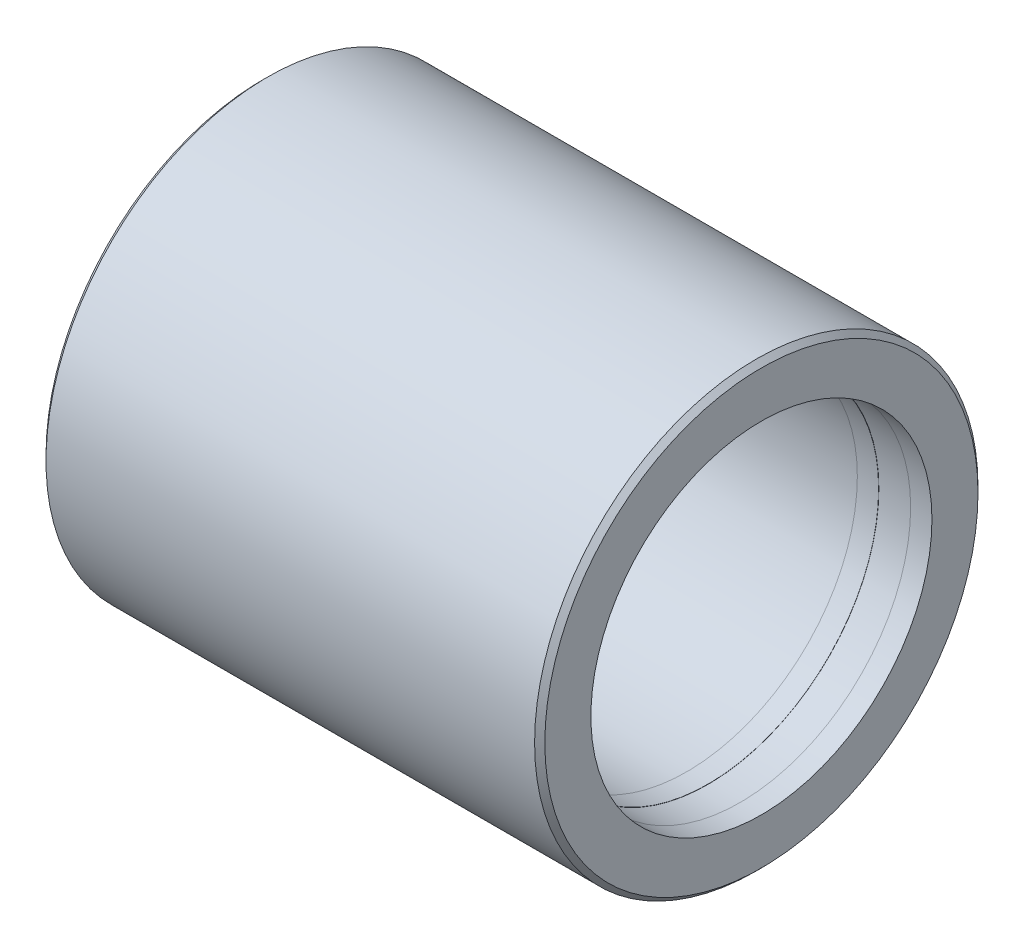
ISO-10303-21;
HEADER;
FILE_DESCRIPTION(('STEP AP214'),'2;1');
FILE_NAME('part.step','',(''),(''),'','','');
FILE_SCHEMA(('AUTOMOTIVE_DESIGN { 1 0 10303 214 1 1 1 1 }'));
ENDSEC;
DATA;
#1=APPLICATION_CONTEXT('core data for automotive mechanical design processes');
#2=APPLICATION_PROTOCOL_DEFINITION('international standard','automotive_design',2000,#1);
#3=PRODUCT_CONTEXT('',#1,'mechanical');
#4=PRODUCT('Part','Part','',(#3));
#5=PRODUCT_RELATED_PRODUCT_CATEGORY('part','',(#4));
#6=PRODUCT_DEFINITION_FORMATION('','',#4);
#7=PRODUCT_DEFINITION_CONTEXT('part definition',#1,'design');
#8=PRODUCT_DEFINITION('design','',#6,#7);
#9=PRODUCT_DEFINITION_SHAPE('','',#8);
#10=(LENGTH_UNIT() NAMED_UNIT(*) SI_UNIT(.MILLI.,.METRE.));
#11=(NAMED_UNIT(*) PLANE_ANGLE_UNIT() SI_UNIT($,.RADIAN.));
#12=(NAMED_UNIT(*) SI_UNIT($,.STERADIAN.) SOLID_ANGLE_UNIT());
#13=UNCERTAINTY_MEASURE_WITH_UNIT(LENGTH_MEASURE(1.E-05),#10,'distance_accuracy_value','');
#14=(GEOMETRIC_REPRESENTATION_CONTEXT(3) GLOBAL_UNCERTAINTY_ASSIGNED_CONTEXT((#13)) GLOBAL_UNIT_ASSIGNED_CONTEXT((#10,
#11,#12)) REPRESENTATION_CONTEXT('',''));
#15=CARTESIAN_POINT('',(0.,0.,0.));
#16=DIRECTION('',(0.,0.,1.));
#17=DIRECTION('',(1.,0.,0.));
#18=AXIS2_PLACEMENT_3D('',#15,#16,#17);
#19=CARTESIAN_POINT('',(5.55625,0.,0.));
#20=DIRECTION('',(1.,0.,0.));
#21=DIRECTION('',(0.,0.,-1.));
#22=AXIS2_PLACEMENT_3D('',#19,#20,#21);
#23=CYLINDRICAL_SURFACE('',#22,12.715840435);
#24=CARTESIAN_POINT('',(31.59125,0.,0.));
#25=DIRECTION('',(1.,0.,0.));
#26=DIRECTION('',(0.,0.,-1.));
#27=AXIS2_PLACEMENT_3D('',#24,#25,#26);
#28=CIRCLE('',#27,12.715840435);
#29=CARTESIAN_POINT('',(31.59125,0.,-12.715840435));
#30=VERTEX_POINT('',#29);
#31=EDGE_CURVE('E18',#30,#30,#28,.F.);
#32=ORIENTED_EDGE('',*,*,#31,.F.);
#33=EDGE_LOOP('',(#32));
#34=FACE_BOUND('',#33,.T.);
#35=CARTESIAN_POINT('',(5.55625,0.,0.));
#36=DIRECTION('',(1.,0.,0.));
#37=DIRECTION('',(0.,0.,-1.));
#38=AXIS2_PLACEMENT_3D('',#35,#36,#37);
#39=CIRCLE('',#38,12.715840435);
#40=CARTESIAN_POINT('',(5.55625,0.,-12.715840435));
#41=VERTEX_POINT('',#40);
#42=EDGE_CURVE('E87',#41,#41,#39,.T.);
#43=ORIENTED_EDGE('',*,*,#42,.F.);
#44=EDGE_LOOP('',(#43));
#45=FACE_BOUND('',#44,.T.);
#46=ADVANCED_FACE('F14',(#34,#45),#23,.F.);
#47=CARTESIAN_POINT('',(31.59125,-12.86843052,-12.86843052));
#48=DIRECTION('',(-1.,0.,0.));
#49=DIRECTION('',(0.,0.,1.));
#50=AXIS2_PLACEMENT_3D('',#47,#48,#49);
#51=PLANE('',#50);
#52=CARTESIAN_POINT('',(31.59125,0.,0.));
#53=DIRECTION('',(1.,0.,0.));
#54=DIRECTION('',(0.,0.,-1.));
#55=AXIS2_PLACEMENT_3D('',#52,#53,#54);
#56=CIRCLE('',#55,12.7);
#57=CARTESIAN_POINT('',(31.59125,0.,-12.7));
#58=VERTEX_POINT('',#57);
#59=EDGE_CURVE('E84',#58,#58,#56,.F.);
#60=ORIENTED_EDGE('',*,*,#59,.F.);
#61=EDGE_LOOP('',(#60));
#62=FACE_BOUND('',#61,.T.);
#63=ORIENTED_EDGE('',*,*,#31,.T.);
#64=EDGE_LOOP('',(#63));
#65=FACE_BOUND('',#64,.T.);
#66=ADVANCED_FACE('F96',(#62,#65),#51,.T.);
#67=CARTESIAN_POINT('',(5.55625,-12.86843052,12.86843052));
#68=DIRECTION('',(1.,0.,0.));
#69=DIRECTION('',(0.,0.,-1.));
#70=AXIS2_PLACEMENT_3D('',#67,#68,#69);
#71=PLANE('',#70);
#72=CARTESIAN_POINT('',(5.55625,0.,0.));
#73=DIRECTION('',(1.,0.,0.));
#74=DIRECTION('',(0.,0.,-1.));
#75=AXIS2_PLACEMENT_3D('',#72,#73,#74);
#76=CIRCLE('',#75,12.7);
#77=CARTESIAN_POINT('',(5.55625,0.,-12.7));
#78=VERTEX_POINT('',#77);
#79=EDGE_CURVE('E80',#78,#78,#76,.T.);
#80=ORIENTED_EDGE('',*,*,#79,.F.);
#81=EDGE_LOOP('',(#80));
#82=FACE_BOUND('',#81,.T.);
#83=ORIENTED_EDGE('',*,*,#42,.T.);
#84=EDGE_LOOP('',(#83));
#85=FACE_BOUND('',#84,.T.);
#86=ADVANCED_FACE('F105',(#82,#85),#71,.T.);
#87=CARTESIAN_POINT('',(31.59125,0.,0.));
#88=DIRECTION('',(1.,0.,0.));
#89=DIRECTION('',(0.,0.,-1.));
#90=AXIS2_PLACEMENT_3D('',#87,#88,#89);
#91=CYLINDRICAL_SURFACE('',#90,12.7);
#92=ORIENTED_EDGE('',*,*,#59,.T.);
#93=EDGE_LOOP('',(#92));
#94=FACE_BOUND('',#93,.T.);
#95=CARTESIAN_POINT('',(33.17875,0.,0.));
#96=DIRECTION('',(1.,0.,0.));
#97=DIRECTION('',(0.,0.,-1.));
#98=AXIS2_PLACEMENT_3D('',#95,#96,#97);
#99=CIRCLE('',#98,12.7);
#100=CARTESIAN_POINT('',(33.17875,0.,-12.7));
#101=VERTEX_POINT('',#100);
#102=EDGE_CURVE('E77',#101,#101,#99,.F.);
#103=ORIENTED_EDGE('',*,*,#102,.F.);
#104=EDGE_LOOP('',(#103));
#105=FACE_BOUND('',#104,.T.);
#106=ADVANCED_FACE('F149',(#94,#105),#91,.F.);
#107=CARTESIAN_POINT('',(3.96875,0.,0.));
#108=DIRECTION('',(1.,0.,0.));
#109=DIRECTION('',(0.,0.,-1.));
#110=AXIS2_PLACEMENT_3D('',#107,#108,#109);
#111=CYLINDRICAL_SURFACE('',#110,12.7);
#112=ORIENTED_EDGE('',*,*,#79,.T.);
#113=EDGE_LOOP('',(#112));
#114=FACE_BOUND('',#113,.T.);
#115=CARTESIAN_POINT('',(3.96875,0.,0.));
#116=DIRECTION('',(1.,0.,0.));
#117=DIRECTION('',(0.,0.,-1.));
#118=AXIS2_PLACEMENT_3D('',#115,#116,#117);
#119=CIRCLE('',#118,12.7);
#120=CARTESIAN_POINT('',(3.96875,0.,-12.7));
#121=VERTEX_POINT('',#120);
#122=EDGE_CURVE('E73',#121,#121,#119,.T.);
#123=ORIENTED_EDGE('',*,*,#122,.F.);
#124=EDGE_LOOP('',(#123));
#125=FACE_BOUND('',#124,.T.);
#126=ADVANCED_FACE('F146',(#114,#125),#111,.F.);
#127=CARTESIAN_POINT('',(33.17875,-12.86843052,12.86843052));
#128=DIRECTION('',(1.,0.,0.));
#129=DIRECTION('',(0.,0.,-1.));
#130=AXIS2_PLACEMENT_3D('',#127,#128,#129);
#131=PLANE('',#130);
#132=ORIENTED_EDGE('',*,*,#102,.T.);
#133=EDGE_LOOP('',(#132));
#134=FACE_BOUND('',#133,.T.);
#135=CARTESIAN_POINT('',(33.17875,0.,0.));
#136=DIRECTION('',(1.,0.,0.));
#137=DIRECTION('',(0.,0.,-1.));
#138=AXIS2_PLACEMENT_3D('',#135,#136,#137);
#139=CIRCLE('',#138,12.715840435);
#140=CARTESIAN_POINT('',(33.17875,0.,-12.715840435));
#141=VERTEX_POINT('',#140);
#142=EDGE_CURVE('E69',#141,#141,#139,.F.);
#143=ORIENTED_EDGE('',*,*,#142,.F.);
#144=EDGE_LOOP('',(#143));
#145=FACE_BOUND('',#144,.T.);
#146=ADVANCED_FACE('F148',(#134,#145),#131,.T.);
#147=CARTESIAN_POINT('',(3.96875,-12.86843052,-12.86843052));
#148=DIRECTION('',(-1.,0.,0.));
#149=DIRECTION('',(0.,0.,1.));
#150=AXIS2_PLACEMENT_3D('',#147,#148,#149);
#151=PLANE('',#150);
#152=ORIENTED_EDGE('',*,*,#122,.T.);
#153=EDGE_LOOP('',(#152));
#154=FACE_BOUND('',#153,.T.);
#155=CARTESIAN_POINT('',(3.96875,0.,0.));
#156=DIRECTION('',(1.,0.,0.));
#157=DIRECTION('',(0.,0.,-1.));
#158=AXIS2_PLACEMENT_3D('',#155,#156,#157);
#159=CIRCLE('',#158,12.715840435);
#160=CARTESIAN_POINT('',(3.96875,0.,-12.715840435));
#161=VERTEX_POINT('',#160);
#162=EDGE_CURVE('E65',#161,#161,#159,.T.);
#163=ORIENTED_EDGE('',*,*,#162,.F.);
#164=EDGE_LOOP('',(#163));
#165=FACE_BOUND('',#164,.T.);
#166=ADVANCED_FACE('F144',(#154,#165),#151,.T.);
#167=CARTESIAN_POINT('',(33.17875,0.,0.));
#168=DIRECTION('',(1.,0.,0.));
#169=DIRECTION('',(0.,0.,-1.));
#170=AXIS2_PLACEMENT_3D('',#167,#168,#169);
#171=CYLINDRICAL_SURFACE('',#170,12.715840435);
#172=ORIENTED_EDGE('',*,*,#142,.T.);
#173=EDGE_LOOP('',(#172));
#174=FACE_BOUND('',#173,.T.);
#175=CARTESIAN_POINT('',(35.56,0.,0.));
#176=DIRECTION('',(1.,0.,0.));
#177=DIRECTION('',(0.,0.,-1.));
#178=AXIS2_PLACEMENT_3D('',#175,#176,#177);
#179=CIRCLE('',#178,12.715840435);
#180=CARTESIAN_POINT('',(35.56,0.,-12.715840435));
#181=VERTEX_POINT('',#180);
#182=EDGE_CURVE('E61',#181,#181,#179,.F.);
#183=ORIENTED_EDGE('',*,*,#182,.F.);
#184=EDGE_LOOP('',(#183));
#185=FACE_BOUND('',#184,.T.);
#186=ADVANCED_FACE('F140',(#174,#185),#171,.F.);
#187=CARTESIAN_POINT('',(1.5875,0.,0.));
#188=DIRECTION('',(1.,0.,0.));
#189=DIRECTION('',(0.,0.,-1.));
#190=AXIS2_PLACEMENT_3D('',#187,#188,#189);
#191=CYLINDRICAL_SURFACE('',#190,12.715840435);
#192=ORIENTED_EDGE('',*,*,#162,.T.);
#193=EDGE_LOOP('',(#192));
#194=FACE_BOUND('',#193,.T.);
#195=CARTESIAN_POINT('',(1.5875,0.,0.));
#196=DIRECTION('',(1.,0.,0.));
#197=DIRECTION('',(0.,0.,-1.));
#198=AXIS2_PLACEMENT_3D('',#195,#196,#197);
#199=CIRCLE('',#198,12.715840435);
#200=CARTESIAN_POINT('',(1.5875,0.,-12.715840435));
#201=VERTEX_POINT('',#200);
#202=EDGE_CURVE('E58',#201,#201,#199,.T.);
#203=ORIENTED_EDGE('',*,*,#202,.F.);
#204=EDGE_LOOP('',(#203));
#205=FACE_BOUND('',#204,.T.);
#206=ADVANCED_FACE('F136',(#194,#205),#191,.F.);
#207=CARTESIAN_POINT('',(35.56,-12.86843052,-12.86843052));
#208=DIRECTION('',(-1.,0.,0.));
#209=DIRECTION('',(0.,0.,1.));
#210=AXIS2_PLACEMENT_3D('',#207,#208,#209);
#211=PLANE('',#210);
#212=CARTESIAN_POINT('',(35.56,0.,0.));
#213=DIRECTION('',(1.,0.,0.));
#214=DIRECTION('',(0.,0.,-1.));
#215=AXIS2_PLACEMENT_3D('',#212,#213,#214);
#216=CIRCLE('',#215,12.7);
#217=CARTESIAN_POINT('',(35.56,0.,-12.7));
#218=VERTEX_POINT('',#217);
#219=EDGE_CURVE('E54',#218,#218,#216,.F.);
#220=ORIENTED_EDGE('',*,*,#219,.F.);
#221=EDGE_LOOP('',(#220));
#222=FACE_BOUND('',#221,.T.);
#223=ORIENTED_EDGE('',*,*,#182,.T.);
#224=EDGE_LOOP('',(#223));
#225=FACE_BOUND('',#224,.T.);
#226=ADVANCED_FACE('F139',(#222,#225),#211,.T.);
#227=CARTESIAN_POINT('',(1.5875,-12.86843052,12.86843052));
#228=DIRECTION('',(1.,0.,0.));
#229=DIRECTION('',(0.,0.,-1.));
#230=AXIS2_PLACEMENT_3D('',#227,#228,#229);
#231=PLANE('',#230);
#232=CARTESIAN_POINT('',(1.5875,0.,0.));
#233=DIRECTION('',(1.,0.,0.));
#234=DIRECTION('',(0.,0.,-1.));
#235=AXIS2_PLACEMENT_3D('',#232,#233,#234);
#236=CIRCLE('',#235,12.7);
#237=CARTESIAN_POINT('',(1.5875,0.,-12.7));
#238=VERTEX_POINT('',#237);
#239=EDGE_CURVE('E50',#238,#238,#236,.T.);
#240=ORIENTED_EDGE('',*,*,#239,.F.);
#241=EDGE_LOOP('',(#240));
#242=FACE_BOUND('',#241,.T.);
#243=ORIENTED_EDGE('',*,*,#202,.T.);
#244=EDGE_LOOP('',(#243));
#245=FACE_BOUND('',#244,.T.);
#246=ADVANCED_FACE('F134',(#242,#245),#231,.T.);
#247=CARTESIAN_POINT('',(35.56,0.,0.));
#248=DIRECTION('',(1.,0.,0.));
#249=DIRECTION('',(0.,0.,-1.));
#250=AXIS2_PLACEMENT_3D('',#247,#248,#249);
#251=CYLINDRICAL_SURFACE('',#250,12.7);
#252=ORIENTED_EDGE('',*,*,#219,.T.);
#253=EDGE_LOOP('',(#252));
#254=FACE_BOUND('',#253,.T.);
#255=CARTESIAN_POINT('',(37.1475,0.,0.));
#256=DIRECTION('',(1.,0.,0.));
#257=DIRECTION('',(0.,0.,-1.));
#258=AXIS2_PLACEMENT_3D('',#255,#256,#257);
#259=CIRCLE('',#258,12.7);
#260=CARTESIAN_POINT('',(37.1475,0.,-12.7));
#261=VERTEX_POINT('',#260);
#262=EDGE_CURVE('E46',#261,#261,#259,.F.);
#263=ORIENTED_EDGE('',*,*,#262,.F.);
#264=EDGE_LOOP('',(#263));
#265=FACE_BOUND('',#264,.T.);
#266=ADVANCED_FACE('F130',(#254,#265),#251,.F.);
#267=CARTESIAN_POINT('',(0.,0.,0.));
#268=DIRECTION('',(1.,0.,0.));
#269=DIRECTION('',(0.,0.,-1.));
#270=AXIS2_PLACEMENT_3D('',#267,#268,#269);
#271=CYLINDRICAL_SURFACE('',#270,12.7);
#272=ORIENTED_EDGE('',*,*,#239,.T.);
#273=EDGE_LOOP('',(#272));
#274=FACE_BOUND('',#273,.T.);
#275=CARTESIAN_POINT('',(0.,0.,0.));
#276=DIRECTION('',(1.,0.,0.));
#277=DIRECTION('',(0.,0.,-1.));
#278=AXIS2_PLACEMENT_3D('',#275,#276,#277);
#279=CIRCLE('',#278,12.7);
#280=CARTESIAN_POINT('',(0.,0.,-12.7));
#281=VERTEX_POINT('',#280);
#282=EDGE_CURVE('E42',#281,#281,#279,.T.);
#283=ORIENTED_EDGE('',*,*,#282,.F.);
#284=EDGE_LOOP('',(#283));
#285=FACE_BOUND('',#284,.T.);
#286=ADVANCED_FACE('F126',(#274,#285),#271,.F.);
#287=CARTESIAN_POINT('',(37.1475,-16.322548,16.322548));
#288=DIRECTION('',(1.,0.,0.));
#289=DIRECTION('',(0.,0.,-1.));
#290=AXIS2_PLACEMENT_3D('',#287,#288,#289);
#291=PLANE('',#290);
#292=ORIENTED_EDGE('',*,*,#262,.T.);
#293=EDGE_LOOP('',(#292));
#294=FACE_BOUND('',#293,.T.);
#295=CARTESIAN_POINT('',(37.1475,0.,0.));
#296=DIRECTION('',(-1.,0.,0.));
#297=DIRECTION('',(0.,0.,1.));
#298=AXIS2_PLACEMENT_3D('',#295,#296,#297);
#299=CIRCLE('',#298,16.129);
#300=CARTESIAN_POINT('',(37.1475,0.,16.129));
#301=VERTEX_POINT('',#300);
#302=EDGE_CURVE('E38',#301,#301,#299,.F.);
#303=ORIENTED_EDGE('',*,*,#302,.T.);
#304=EDGE_LOOP('',(#303));
#305=FACE_BOUND('',#304,.T.);
#306=ADVANCED_FACE('F129',(#294,#305),#291,.T.);
#307=CARTESIAN_POINT('',(0.,-16.322548,-16.322548));
#308=DIRECTION('',(-1.,0.,0.));
#309=DIRECTION('',(0.,0.,1.));
#310=AXIS2_PLACEMENT_3D('',#307,#308,#309);
#311=PLANE('',#310);
#312=ORIENTED_EDGE('',*,*,#282,.T.);
#313=EDGE_LOOP('',(#312));
#314=FACE_BOUND('',#313,.T.);
#315=CARTESIAN_POINT('',(0.,0.,0.));
#316=DIRECTION('',(1.,0.,0.));
#317=DIRECTION('',(0.,0.,-1.));
#318=AXIS2_PLACEMENT_3D('',#315,#316,#317);
#319=CIRCLE('',#318,16.129);
#320=CARTESIAN_POINT('',(0.,0.,-16.129));
#321=VERTEX_POINT('',#320);
#322=EDGE_CURVE('E32',#321,#321,#319,.F.);
#323=ORIENTED_EDGE('',*,*,#322,.T.);
#324=EDGE_LOOP('',(#323));
#325=FACE_BOUND('',#324,.T.);
#326=ADVANCED_FACE('F16',(#314,#325),#311,.T.);
#327=CARTESIAN_POINT('',(37.1475,0.,0.));
#328=DIRECTION('',(-1.,0.,0.));
#329=DIRECTION('',(0.,0.,1.));
#330=AXIS2_PLACEMENT_3D('',#327,#328,#329);
#331=CONICAL_SURFACE('',#330,16.129,0.785398163397457);
#332=CARTESIAN_POINT('',(36.7665,0.,0.));
#333=DIRECTION('',(1.,0.,0.));
#334=DIRECTION('',(0.,0.,-1.));
#335=AXIS2_PLACEMENT_3D('',#332,#333,#334);
#336=CIRCLE('',#335,16.51);
#337=CARTESIAN_POINT('',(36.7665,0.,-16.51));
#338=VERTEX_POINT('',#337);
#339=EDGE_CURVE('E23',#338,#338,#336,.T.);
#340=ORIENTED_EDGE('',*,*,#339,.T.);
#341=EDGE_LOOP('',(#340));
#342=FACE_BOUND('',#341,.T.);
#343=ORIENTED_EDGE('',*,*,#302,.F.);
#344=EDGE_LOOP('',(#343));
#345=FACE_BOUND('',#344,.T.);
#346=ADVANCED_FACE('F117',(#342,#345),#331,.T.);
#347=CARTESIAN_POINT('',(0.,0.,0.));
#348=DIRECTION('',(1.,0.,0.));
#349=DIRECTION('',(0.,0.,-1.));
#350=AXIS2_PLACEMENT_3D('',#347,#348,#349);
#351=CONICAL_SURFACE('',#350,16.129,0.785398163397448);
#352=ORIENTED_EDGE('',*,*,#322,.F.);
#353=EDGE_LOOP('',(#352));
#354=FACE_BOUND('',#353,.T.);
#355=CARTESIAN_POINT('',(0.380999999999999,0.,0.));
#356=DIRECTION('',(1.,0.,0.));
#357=DIRECTION('',(0.,0.,-1.));
#358=AXIS2_PLACEMENT_3D('',#355,#356,#357);
#359=CIRCLE('',#358,16.51);
#360=CARTESIAN_POINT('',(0.381,0.,-16.51));
#361=VERTEX_POINT('',#360);
#362=EDGE_CURVE('E10',#361,#361,#359,.F.);
#363=ORIENTED_EDGE('',*,*,#362,.T.);
#364=EDGE_LOOP('',(#363));
#365=FACE_BOUND('',#364,.T.);
#366=ADVANCED_FACE('F111',(#354,#365),#351,.T.);
#367=CARTESIAN_POINT('',(0.381,0.,0.));
#368=DIRECTION('',(1.,0.,0.));
#369=DIRECTION('',(0.,1.,0.));
#370=AXIS2_PLACEMENT_3D('',#367,#368,#369);
#371=CYLINDRICAL_SURFACE('',#370,16.51);
#372=ORIENTED_EDGE('',*,*,#339,.F.);
#373=EDGE_LOOP('',(#372));
#374=FACE_BOUND('',#373,.T.);
#375=ORIENTED_EDGE('',*,*,#362,.F.);
#376=EDGE_LOOP('',(#375));
#377=FACE_BOUND('',#376,.T.);
#378=ADVANCED_FACE('F109',(#374,#377),#371,.T.);
#379=CLOSED_SHELL('',(#46,#66,#86,#106,#126,#146,#166,#186,#206,#226,#246,#266,#286,#306,#326,
#346,#366,#378));
#380=MANIFOLD_SOLID_BREP('B1',#379);
#381=ADVANCED_BREP_SHAPE_REPRESENTATION('',(#18,#380),#14);
#382=SHAPE_DEFINITION_REPRESENTATION(#9,#381);
ENDSEC;
END-ISO-10303-21;
